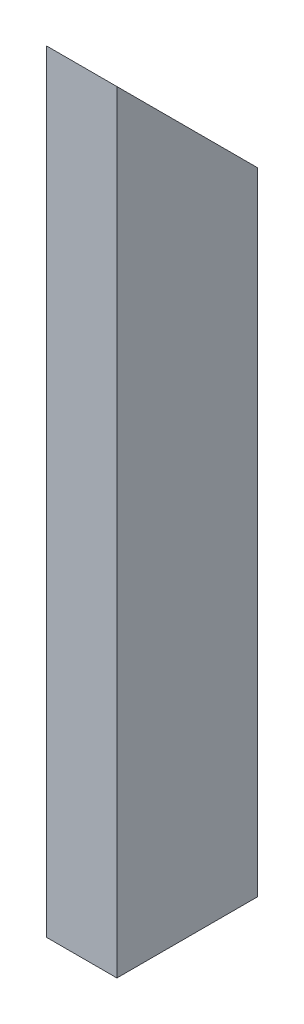
ISO-10303-21;
HEADER;
FILE_DESCRIPTION(('STEP AP214'),'2;1');
FILE_NAME('part.step','',(''),(''),'','','');
FILE_SCHEMA(('AUTOMOTIVE_DESIGN { 1 0 10303 214 1 1 1 1 }'));
ENDSEC;
DATA;
#1=APPLICATION_CONTEXT('core data for automotive mechanical design processes');
#2=APPLICATION_PROTOCOL_DEFINITION('international standard','automotive_design',2000,#1);
#3=PRODUCT_CONTEXT('',#1,'mechanical');
#4=PRODUCT('Part','Part','',(#3));
#5=PRODUCT_RELATED_PRODUCT_CATEGORY('part','',(#4));
#6=PRODUCT_DEFINITION_FORMATION('','',#4);
#7=PRODUCT_DEFINITION_CONTEXT('part definition',#1,'design');
#8=PRODUCT_DEFINITION('design','',#6,#7);
#9=PRODUCT_DEFINITION_SHAPE('','',#8);
#10=(LENGTH_UNIT() NAMED_UNIT(*) SI_UNIT(.MILLI.,.METRE.));
#11=(NAMED_UNIT(*) PLANE_ANGLE_UNIT() SI_UNIT($,.RADIAN.));
#12=(NAMED_UNIT(*) SI_UNIT($,.STERADIAN.) SOLID_ANGLE_UNIT());
#13=UNCERTAINTY_MEASURE_WITH_UNIT(LENGTH_MEASURE(1.E-05),#10,'distance_accuracy_value','');
#14=(GEOMETRIC_REPRESENTATION_CONTEXT(3) GLOBAL_UNCERTAINTY_ASSIGNED_CONTEXT((#13)) GLOBAL_UNIT_ASSIGNED_CONTEXT((#10,
#11,#12)) REPRESENTATION_CONTEXT('',''));
#15=CARTESIAN_POINT('',(0.,0.,0.));
#16=DIRECTION('',(0.,0.,1.));
#17=DIRECTION('',(1.,0.,0.));
#18=AXIS2_PLACEMENT_3D('',#15,#16,#17);
#19=CARTESIAN_POINT('',(0.,0.,0.));
#20=DIRECTION('',(0.,-1.,0.));
#21=DIRECTION('',(0.,0.,-1.));
#22=AXIS2_PLACEMENT_3D('',#19,#20,#21);
#23=PLANE('',#22);
#24=DIRECTION('',(0.,0.,1.));
#25=VECTOR('',#24,1.);
#26=CARTESIAN_POINT('',(0.,0.,0.));
#27=LINE('',#26,#25);
#28=CARTESIAN_POINT('',(0.,0.,-50.8));
#29=VERTEX_POINT('',#28);
#30=CARTESIAN_POINT('',(0.,0.,0.));
#31=VERTEX_POINT('',#30);
#32=EDGE_CURVE('E126',#29,#31,#27,.T.);
#33=ORIENTED_EDGE('',*,*,#32,.F.);
#34=DIRECTION('',(-1.,0.,0.));
#35=VECTOR('',#34,1.);
#36=CARTESIAN_POINT('',(0.,0.,-50.8));
#37=LINE('',#36,#35);
#38=CARTESIAN_POINT('',(25.4,0.,-50.8));
#39=VERTEX_POINT('',#38);
#40=EDGE_CURVE('E103',#39,#29,#37,.T.);
#41=ORIENTED_EDGE('',*,*,#40,.F.);
#42=DIRECTION('',(0.,0.,-1.));
#43=VECTOR('',#42,1.);
#44=CARTESIAN_POINT('',(25.4,0.,0.));
#45=LINE('',#44,#43);
#46=CARTESIAN_POINT('',(25.4,0.,0.));
#47=VERTEX_POINT('',#46);
#48=EDGE_CURVE('E123',#47,#39,#45,.T.);
#49=ORIENTED_EDGE('',*,*,#48,.F.);
#50=DIRECTION('',(1.,0.,0.));
#51=VECTOR('',#50,1.);
#52=CARTESIAN_POINT('',(0.,0.,0.));
#53=LINE('',#52,#51);
#54=EDGE_CURVE('E116',#31,#47,#53,.T.);
#55=ORIENTED_EDGE('',*,*,#54,.F.);
#56=EDGE_LOOP('',(#33,#41,#49,#55));
#57=FACE_BOUND('',#56,.T.);
#58=DIRECTION('',(-1.,0.,0.));
#59=VECTOR('',#58,1.);
#60=CARTESIAN_POINT('',(3.175,0.,-47.625));
#61=LINE('',#60,#59);
#62=CARTESIAN_POINT('',(22.225,0.,-47.625));
#63=VERTEX_POINT('',#62);
#64=CARTESIAN_POINT('',(3.175,0.,-47.625));
#65=VERTEX_POINT('',#64);
#66=EDGE_CURVE('E137',#63,#65,#61,.T.);
#67=ORIENTED_EDGE('',*,*,#66,.T.);
#68=DIRECTION('',(0.,0.,1.));
#69=VECTOR('',#68,1.);
#70=CARTESIAN_POINT('',(3.175,0.,-3.175));
#71=LINE('',#70,#69);
#72=CARTESIAN_POINT('',(3.175,0.,-3.175));
#73=VERTEX_POINT('',#72);
#74=EDGE_CURVE('E146',#65,#73,#71,.T.);
#75=ORIENTED_EDGE('',*,*,#74,.T.);
#76=DIRECTION('',(1.,0.,0.));
#77=VECTOR('',#76,1.);
#78=CARTESIAN_POINT('',(3.175,0.,-3.175));
#79=LINE('',#78,#77);
#80=CARTESIAN_POINT('',(22.225,0.,-3.175));
#81=VERTEX_POINT('',#80);
#82=EDGE_CURVE('E143',#73,#81,#79,.T.);
#83=ORIENTED_EDGE('',*,*,#82,.T.);
#84=DIRECTION('',(0.,0.,-1.));
#85=VECTOR('',#84,1.);
#86=CARTESIAN_POINT('',(22.225,0.,-3.175));
#87=LINE('',#86,#85);
#88=EDGE_CURVE('E140',#81,#63,#87,.T.);
#89=ORIENTED_EDGE('',*,*,#88,.T.);
#90=EDGE_LOOP('',(#67,#75,#83,#89));
#91=FACE_BOUND('',#90,.T.);
#92=ADVANCED_FACE('F32',(#57,#91),#23,.T.);
#93=CARTESIAN_POINT('',(0.,279.4,0.));
#94=DIRECTION('',(1.,0.,0.));
#95=DIRECTION('',(0.,0.,-1.));
#96=AXIS2_PLACEMENT_3D('',#93,#94,#95);
#97=PLANE('',#96);
#98=DIRECTION('',(0.,-1.,0.));
#99=VECTOR('',#98,1.);
#100=CARTESIAN_POINT('',(0.,279.4,0.));
#101=LINE('',#100,#99);
#102=CARTESIAN_POINT('',(0.,279.4,0.));
#103=VERTEX_POINT('',#102);
#104=EDGE_CURVE('E40',#103,#31,#101,.T.);
#105=ORIENTED_EDGE('',*,*,#104,.F.);
#106=DIRECTION('',(0.,-0.707106781186547,-0.707106781186548));
#107=VECTOR('',#106,1.);
#108=CARTESIAN_POINT('',(0.,279.4,0.));
#109=LINE('',#108,#107);
#110=CARTESIAN_POINT('',(0.,228.6,-50.8));
#111=VERTEX_POINT('',#110);
#112=EDGE_CURVE('E97',#103,#111,#109,.T.);
#113=ORIENTED_EDGE('',*,*,#112,.T.);
#114=DIRECTION('',(0.,-1.,0.));
#115=VECTOR('',#114,1.);
#116=CARTESIAN_POINT('',(0.,279.4,-50.8));
#117=LINE('',#116,#115);
#118=EDGE_CURVE('E102',#111,#29,#117,.T.);
#119=ORIENTED_EDGE('',*,*,#118,.T.);
#120=ORIENTED_EDGE('',*,*,#32,.T.);
#121=EDGE_LOOP('',(#105,#113,#119,#120));
#122=FACE_BOUND('',#121,.T.);
#123=ADVANCED_FACE('F34',(#122),#97,.F.);
#124=CARTESIAN_POINT('',(0.,279.4,0.));
#125=DIRECTION('',(0.,0.,-1.));
#126=DIRECTION('',(-1.,0.,0.));
#127=AXIS2_PLACEMENT_3D('',#124,#125,#126);
#128=PLANE('',#127);
#129=ORIENTED_EDGE('',*,*,#54,.T.);
#130=DIRECTION('',(0.,-1.,0.));
#131=VECTOR('',#130,1.);
#132=CARTESIAN_POINT('',(25.4,279.4,0.));
#133=LINE('',#132,#131);
#134=CARTESIAN_POINT('',(25.4,279.4,0.));
#135=VERTEX_POINT('',#134);
#136=EDGE_CURVE('E110',#135,#47,#133,.T.);
#137=ORIENTED_EDGE('',*,*,#136,.F.);
#138=DIRECTION('',(1.,0.,0.));
#139=VECTOR('',#138,1.);
#140=CARTESIAN_POINT('',(0.,279.4,0.));
#141=LINE('',#140,#139);
#142=EDGE_CURVE('E94',#103,#135,#141,.T.);
#143=ORIENTED_EDGE('',*,*,#142,.F.);
#144=ORIENTED_EDGE('',*,*,#104,.T.);
#145=EDGE_LOOP('',(#129,#137,#143,#144));
#146=FACE_BOUND('',#145,.T.);
#147=ADVANCED_FACE('F115',(#146),#128,.F.);
#148=CARTESIAN_POINT('',(25.4,279.4,0.));
#149=DIRECTION('',(-1.,0.,0.));
#150=DIRECTION('',(0.,0.,1.));
#151=AXIS2_PLACEMENT_3D('',#148,#149,#150);
#152=PLANE('',#151);
#153=DIRECTION('',(0.,-1.,0.));
#154=VECTOR('',#153,1.);
#155=CARTESIAN_POINT('',(25.4,279.4,-50.8));
#156=LINE('',#155,#154);
#157=CARTESIAN_POINT('',(25.4,228.6,-50.8));
#158=VERTEX_POINT('',#157);
#159=EDGE_CURVE('E112',#158,#39,#156,.T.);
#160=ORIENTED_EDGE('',*,*,#159,.F.);
#161=DIRECTION('',(0.,-0.707106781186547,-0.707106781186548));
#162=VECTOR('',#161,1.);
#163=CARTESIAN_POINT('',(25.4,279.4,0.));
#164=LINE('',#163,#162);
#165=EDGE_CURVE('E47',#135,#158,#164,.T.);
#166=ORIENTED_EDGE('',*,*,#165,.F.);
#167=ORIENTED_EDGE('',*,*,#136,.T.);
#168=ORIENTED_EDGE('',*,*,#48,.T.);
#169=EDGE_LOOP('',(#160,#166,#167,#168));
#170=FACE_BOUND('',#169,.T.);
#171=ADVANCED_FACE('F108',(#170),#152,.F.);
#172=CARTESIAN_POINT('',(0.,279.4,-50.8));
#173=DIRECTION('',(0.,0.,1.));
#174=DIRECTION('',(1.,0.,0.));
#175=AXIS2_PLACEMENT_3D('',#172,#173,#174);
#176=PLANE('',#175);
#177=ORIENTED_EDGE('',*,*,#118,.F.);
#178=DIRECTION('',(1.,0.,0.));
#179=VECTOR('',#178,1.);
#180=CARTESIAN_POINT('',(-254.,228.6,-50.8));
#181=LINE('',#180,#179);
#182=EDGE_CURVE('E113',#111,#158,#181,.T.);
#183=ORIENTED_EDGE('',*,*,#182,.T.);
#184=ORIENTED_EDGE('',*,*,#159,.T.);
#185=ORIENTED_EDGE('',*,*,#40,.T.);
#186=EDGE_LOOP('',(#177,#183,#184,#185));
#187=FACE_BOUND('',#186,.T.);
#188=ADVANCED_FACE('F157',(#187),#176,.F.);
#189=CARTESIAN_POINT('',(3.175,279.4,-3.175));
#190=DIRECTION('',(1.,0.,0.));
#191=DIRECTION('',(0.,0.,-1.));
#192=AXIS2_PLACEMENT_3D('',#189,#190,#191);
#193=PLANE('',#192);
#194=DIRECTION('',(0.,-0.707106781186547,-0.707106781186548));
#195=VECTOR('',#194,1.);
#196=CARTESIAN_POINT('',(3.175,277.8125,-1.5875));
#197=LINE('',#196,#195);
#198=CARTESIAN_POINT('',(3.175,276.225,-3.175));
#199=VERTEX_POINT('',#198);
#200=CARTESIAN_POINT('',(3.175,231.775,-47.625));
#201=VERTEX_POINT('',#200);
#202=EDGE_CURVE('E54',#199,#201,#197,.T.);
#203=ORIENTED_EDGE('',*,*,#202,.F.);
#204=DIRECTION('',(0.,-1.,0.));
#205=VECTOR('',#204,1.);
#206=CARTESIAN_POINT('',(3.175,279.4,-3.175));
#207=LINE('',#206,#205);
#208=EDGE_CURVE('E128',#199,#73,#207,.T.);
#209=ORIENTED_EDGE('',*,*,#208,.T.);
#210=ORIENTED_EDGE('',*,*,#74,.F.);
#211=DIRECTION('',(0.,-1.,0.));
#212=VECTOR('',#211,1.);
#213=CARTESIAN_POINT('',(3.175,279.4,-47.625));
#214=LINE('',#213,#212);
#215=EDGE_CURVE('E135',#201,#65,#214,.T.);
#216=ORIENTED_EDGE('',*,*,#215,.F.);
#217=EDGE_LOOP('',(#203,#209,#210,#216));
#218=FACE_BOUND('',#217,.T.);
#219=ADVANCED_FACE('F173',(#218),#193,.T.);
#220=CARTESIAN_POINT('',(3.175,279.4,-3.175));
#221=DIRECTION('',(0.,0.,-1.));
#222=DIRECTION('',(-1.,0.,0.));
#223=AXIS2_PLACEMENT_3D('',#220,#221,#222);
#224=PLANE('',#223);
#225=DIRECTION('',(-1.,0.,0.));
#226=VECTOR('',#225,1.);
#227=CARTESIAN_POINT('',(3.175,276.225,-3.175));
#228=LINE('',#227,#226);
#229=CARTESIAN_POINT('',(22.225,276.225,-3.175));
#230=VERTEX_POINT('',#229);
#231=EDGE_CURVE('E151',#230,#199,#228,.T.);
#232=ORIENTED_EDGE('',*,*,#231,.F.);
#233=DIRECTION('',(0.,-1.,0.));
#234=VECTOR('',#233,1.);
#235=CARTESIAN_POINT('',(22.225,279.4,-3.175));
#236=LINE('',#235,#234);
#237=EDGE_CURVE('E131',#230,#81,#236,.T.);
#238=ORIENTED_EDGE('',*,*,#237,.T.);
#239=ORIENTED_EDGE('',*,*,#82,.F.);
#240=ORIENTED_EDGE('',*,*,#208,.F.);
#241=EDGE_LOOP('',(#232,#238,#239,#240));
#242=FACE_BOUND('',#241,.T.);
#243=ADVANCED_FACE('F178',(#242),#224,.T.);
#244=CARTESIAN_POINT('',(22.225,279.4,-3.175));
#245=DIRECTION('',(-1.,0.,0.));
#246=DIRECTION('',(0.,0.,1.));
#247=AXIS2_PLACEMENT_3D('',#244,#245,#246);
#248=PLANE('',#247);
#249=DIRECTION('',(0.,0.707106781186547,0.707106781186548));
#250=VECTOR('',#249,1.);
#251=CARTESIAN_POINT('',(22.225,277.8125,-1.5875));
#252=LINE('',#251,#250);
#253=CARTESIAN_POINT('',(22.225,231.775,-47.625));
#254=VERTEX_POINT('',#253);
#255=EDGE_CURVE('E153',#254,#230,#252,.T.);
#256=ORIENTED_EDGE('',*,*,#255,.F.);
#257=DIRECTION('',(0.,-1.,0.));
#258=VECTOR('',#257,1.);
#259=CARTESIAN_POINT('',(22.225,279.4,-47.625));
#260=LINE('',#259,#258);
#261=EDGE_CURVE('E133',#254,#63,#260,.T.);
#262=ORIENTED_EDGE('',*,*,#261,.T.);
#263=ORIENTED_EDGE('',*,*,#88,.F.);
#264=ORIENTED_EDGE('',*,*,#237,.F.);
#265=EDGE_LOOP('',(#256,#262,#263,#264));
#266=FACE_BOUND('',#265,.T.);
#267=ADVANCED_FACE('F182',(#266),#248,.T.);
#268=CARTESIAN_POINT('',(3.175,279.4,-47.625));
#269=DIRECTION('',(0.,0.,1.));
#270=DIRECTION('',(1.,0.,0.));
#271=AXIS2_PLACEMENT_3D('',#268,#269,#270);
#272=PLANE('',#271);
#273=DIRECTION('',(1.,0.,0.));
#274=VECTOR('',#273,1.);
#275=CARTESIAN_POINT('',(3.175,231.775,-47.625));
#276=LINE('',#275,#274);
#277=EDGE_CURVE('E11',#201,#254,#276,.T.);
#278=ORIENTED_EDGE('',*,*,#277,.F.);
#279=ORIENTED_EDGE('',*,*,#215,.T.);
#280=ORIENTED_EDGE('',*,*,#66,.F.);
#281=ORIENTED_EDGE('',*,*,#261,.F.);
#282=EDGE_LOOP('',(#278,#279,#280,#281));
#283=FACE_BOUND('',#282,.T.);
#284=ADVANCED_FACE('F170',(#283),#272,.T.);
#285=CARTESIAN_POINT('',(-254.,279.4,0.));
#286=DIRECTION('',(0.,-0.707106781186548,0.707106781186547));
#287=DIRECTION('',(0.,-0.707106781186547,-0.707106781186548));
#288=AXIS2_PLACEMENT_3D('',#285,#286,#287);
#289=PLANE('',#288);
#290=ORIENTED_EDGE('',*,*,#202,.T.);
#291=ORIENTED_EDGE('',*,*,#277,.T.);
#292=ORIENTED_EDGE('',*,*,#255,.T.);
#293=ORIENTED_EDGE('',*,*,#231,.T.);
#294=EDGE_LOOP('',(#290,#291,#292,#293));
#295=FACE_BOUND('',#294,.T.);
#296=ORIENTED_EDGE('',*,*,#142,.T.);
#297=ORIENTED_EDGE('',*,*,#165,.T.);
#298=ORIENTED_EDGE('',*,*,#182,.F.);
#299=ORIENTED_EDGE('',*,*,#112,.F.);
#300=EDGE_LOOP('',(#296,#297,#298,#299));
#301=FACE_BOUND('',#300,.T.);
#302=ADVANCED_FACE('F95',(#295,#301),#289,.F.);
#303=CLOSED_SHELL('',(#92,#123,#147,#171,#188,#219,#243,#267,#284,#302));
#304=MANIFOLD_SOLID_BREP('B2',#303);
#305=ADVANCED_BREP_SHAPE_REPRESENTATION('',(#18,#304),#14);
#306=SHAPE_DEFINITION_REPRESENTATION(#9,#305);
ENDSEC;
END-ISO-10303-21;
